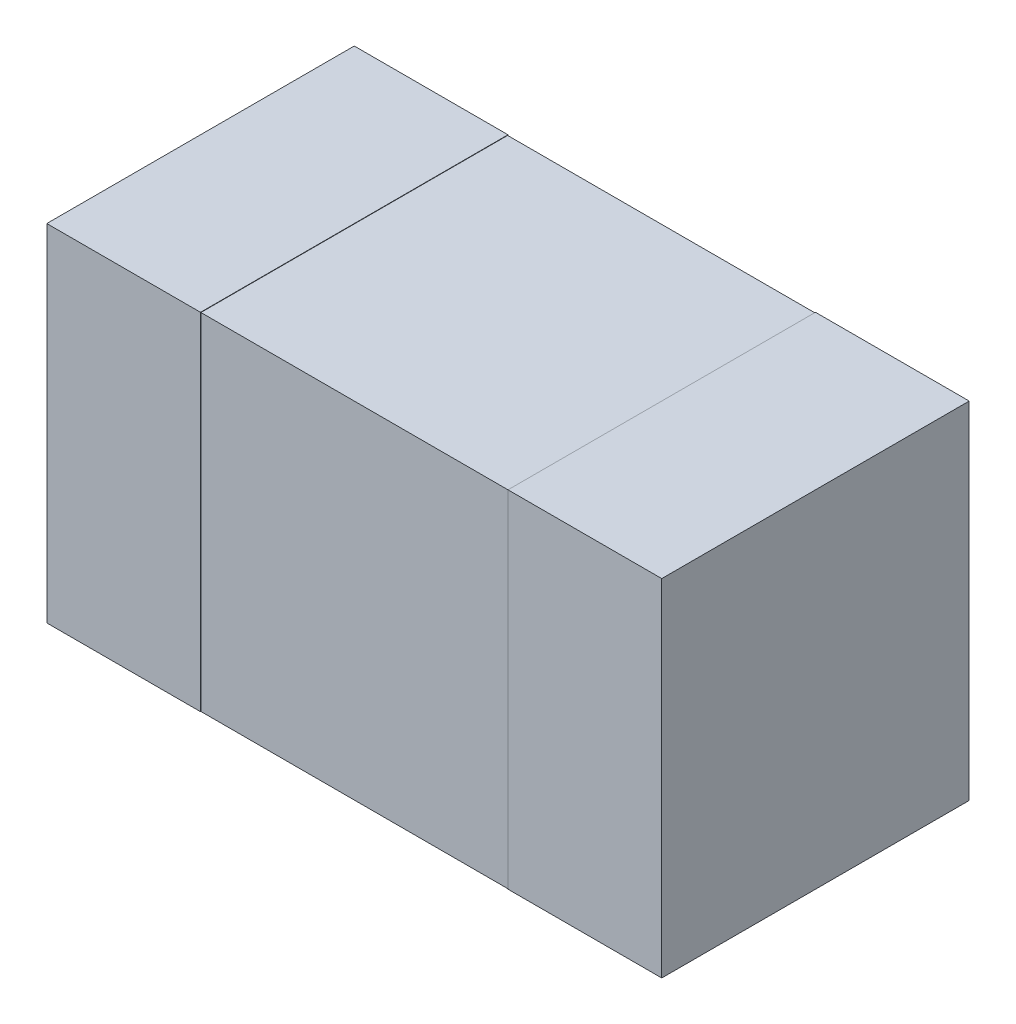
ISO-10303-21;
HEADER;
FILE_DESCRIPTION(('STEP AP214'),'2;1');
FILE_NAME('part.step','',(''),(''),'','','');
FILE_SCHEMA(('AUTOMOTIVE_DESIGN { 1 0 10303 214 1 1 1 1 }'));
ENDSEC;
DATA;
#1=APPLICATION_CONTEXT('core data for automotive mechanical design processes');
#2=APPLICATION_PROTOCOL_DEFINITION('international standard','automotive_design',2000,#1);
#3=PRODUCT_CONTEXT('',#1,'mechanical');
#4=PRODUCT('Part','Part','',(#3));
#5=PRODUCT_RELATED_PRODUCT_CATEGORY('part','',(#4));
#6=PRODUCT_DEFINITION_FORMATION('','',#4);
#7=PRODUCT_DEFINITION_CONTEXT('part definition',#1,'design');
#8=PRODUCT_DEFINITION('design','',#6,#7);
#9=PRODUCT_DEFINITION_SHAPE('','',#8);
#10=(LENGTH_UNIT() NAMED_UNIT(*) SI_UNIT(.MILLI.,.METRE.));
#11=(NAMED_UNIT(*) PLANE_ANGLE_UNIT() SI_UNIT($,.RADIAN.));
#12=(NAMED_UNIT(*) SI_UNIT($,.STERADIAN.) SOLID_ANGLE_UNIT());
#13=UNCERTAINTY_MEASURE_WITH_UNIT(LENGTH_MEASURE(1.E-05),#10,'distance_accuracy_value','');
#14=(GEOMETRIC_REPRESENTATION_CONTEXT(3) GLOBAL_UNCERTAINTY_ASSIGNED_CONTEXT((#13)) GLOBAL_UNIT_ASSIGNED_CONTEXT((#10,
#11,#12)) REPRESENTATION_CONTEXT('',''));
#15=CARTESIAN_POINT('',(0.,0.,0.));
#16=DIRECTION('',(0.,0.,1.));
#17=DIRECTION('',(1.,0.,0.));
#18=AXIS2_PLACEMENT_3D('',#15,#16,#17);
#19=CARTESIAN_POINT('',(0.,0.45,0.4));
#20=DIRECTION('',(0.,1.,0.));
#21=DIRECTION('',(0.,0.,1.));
#22=AXIS2_PLACEMENT_3D('',#19,#20,#21);
#23=PLANE('',#22);
#24=DIRECTION('',(0.,0.,-1.));
#25=VECTOR('',#24,1.);
#26=CARTESIAN_POINT('',(-0.8,0.45,0.8));
#27=LINE('',#26,#25);
#28=CARTESIAN_POINT('',(-0.8,0.45,0.));
#29=VERTEX_POINT('',#28);
#30=CARTESIAN_POINT('',(-0.8,0.45,0.8));
#31=VERTEX_POINT('',#30);
#32=EDGE_CURVE('E224',#29,#31,#27,.F.);
#33=ORIENTED_EDGE('',*,*,#32,.T.);
#34=DIRECTION('',(-1.,0.,0.));
#35=VECTOR('',#34,1.);
#36=CARTESIAN_POINT('',(0.8,0.45,0.8));
#37=LINE('',#36,#35);
#38=CARTESIAN_POINT('',(-0.4,0.45,0.8));
#39=VERTEX_POINT('',#38);
#40=EDGE_CURVE('E218',#31,#39,#37,.F.);
#41=ORIENTED_EDGE('',*,*,#40,.T.);
#42=DIRECTION('',(0.,0.,1.));
#43=VECTOR('',#42,1.);
#44=CARTESIAN_POINT('',(-0.4,0.45,0.8));
#45=LINE('',#44,#43);
#46=CARTESIAN_POINT('',(-0.400000000000043,0.45,0.));
#47=VERTEX_POINT('',#46);
#48=EDGE_CURVE('E212',#39,#47,#45,.F.);
#49=ORIENTED_EDGE('',*,*,#48,.T.);
#50=DIRECTION('',(1.,0.,0.));
#51=VECTOR('',#50,1.);
#52=CARTESIAN_POINT('',(0.8,0.45,0.));
#53=LINE('',#52,#51);
#54=EDGE_CURVE('E94',#47,#29,#53,.F.);
#55=ORIENTED_EDGE('',*,*,#54,.T.);
#56=EDGE_LOOP('',(#33,#41,#49,#55));
#57=FACE_BOUND('',#56,.T.);
#58=ADVANCED_FACE('F17',(#57),#23,.T.);
#59=CARTESIAN_POINT('',(0.,0.45,0.4));
#60=DIRECTION('',(0.,1.,0.));
#61=DIRECTION('',(0.,0.,1.));
#62=AXIS2_PLACEMENT_3D('',#59,#60,#61);
#63=PLANE('',#62);
#64=DIRECTION('',(-1.,0.,0.));
#65=VECTOR('',#64,1.);
#66=CARTESIAN_POINT('',(0.8,0.45,0.8));
#67=LINE('',#66,#65);
#68=CARTESIAN_POINT('',(0.4,0.45,0.8));
#69=VERTEX_POINT('',#68);
#70=CARTESIAN_POINT('',(0.8,0.45,0.8));
#71=VERTEX_POINT('',#70);
#72=EDGE_CURVE('E108',#69,#71,#67,.F.);
#73=ORIENTED_EDGE('',*,*,#72,.T.);
#74=DIRECTION('',(0.,0.,1.));
#75=VECTOR('',#74,1.);
#76=CARTESIAN_POINT('',(0.8,0.45,0.8));
#77=LINE('',#76,#75);
#78=CARTESIAN_POINT('',(0.8,0.45,0.));
#79=VERTEX_POINT('',#78);
#80=EDGE_CURVE('E137',#71,#79,#77,.F.);
#81=ORIENTED_EDGE('',*,*,#80,.T.);
#82=DIRECTION('',(1.,0.,0.));
#83=VECTOR('',#82,1.);
#84=CARTESIAN_POINT('',(0.8,0.45,0.));
#85=LINE('',#84,#83);
#86=CARTESIAN_POINT('',(0.4,0.45,0.));
#87=VERTEX_POINT('',#86);
#88=EDGE_CURVE('E120',#79,#87,#85,.F.);
#89=ORIENTED_EDGE('',*,*,#88,.T.);
#90=DIRECTION('',(0.,0.,-1.));
#91=VECTOR('',#90,1.);
#92=CARTESIAN_POINT('',(0.4,0.45,0.8));
#93=LINE('',#92,#91);
#94=EDGE_CURVE('E185',#87,#69,#93,.F.);
#95=ORIENTED_EDGE('',*,*,#94,.T.);
#96=EDGE_LOOP('',(#73,#81,#89,#95));
#97=FACE_BOUND('',#96,.T.);
#98=ADVANCED_FACE('F289',(#97),#63,.T.);
#99=CARTESIAN_POINT('',(-0.4,0.449,0.));
#100=DIRECTION('',(0.,-1.,0.));
#101=DIRECTION('',(1.,0.,0.));
#102=AXIS2_PLACEMENT_3D('',#99,#100,#101);
#103=PLANE('',#102);
#104=DIRECTION('',(-1.,0.,0.));
#105=VECTOR('',#104,1.);
#106=CARTESIAN_POINT('',(-0.4,0.449,0.799));
#107=LINE('',#106,#105);
#108=CARTESIAN_POINT('',(-0.4,0.449,0.799));
#109=VERTEX_POINT('',#108);
#110=CARTESIAN_POINT('',(0.4,0.449,0.799));
#111=VERTEX_POINT('',#110);
#112=EDGE_CURVE('E115',#109,#111,#107,.F.);
#113=ORIENTED_EDGE('',*,*,#112,.T.);
#114=DIRECTION('',(0.,0.,-1.));
#115=VECTOR('',#114,1.);
#116=CARTESIAN_POINT('',(0.4,0.449,0.8));
#117=LINE('',#116,#115);
#118=CARTESIAN_POINT('',(0.4,0.449,0.00100000000000003));
#119=VERTEX_POINT('',#118);
#120=EDGE_CURVE('E191',#111,#119,#117,.T.);
#121=ORIENTED_EDGE('',*,*,#120,.T.);
#122=DIRECTION('',(1.,0.,0.));
#123=VECTOR('',#122,1.);
#124=CARTESIAN_POINT('',(-0.4,0.449,0.00100000000000003));
#125=LINE('',#124,#123);
#126=CARTESIAN_POINT('',(-0.400000000000014,0.449,0.00100000000000003));
#127=VERTEX_POINT('',#126);
#128=EDGE_CURVE('E177',#119,#127,#125,.F.);
#129=ORIENTED_EDGE('',*,*,#128,.T.);
#130=DIRECTION('',(0.,0.,1.));
#131=VECTOR('',#130,1.);
#132=CARTESIAN_POINT('',(-0.4,0.449,0.8));
#133=LINE('',#132,#131);
#134=EDGE_CURVE('E69',#127,#109,#133,.T.);
#135=ORIENTED_EDGE('',*,*,#134,.T.);
#136=EDGE_LOOP('',(#113,#121,#129,#135));
#137=FACE_BOUND('',#136,.T.);
#138=ADVANCED_FACE('F294',(#137),#103,.F.);
#139=CARTESIAN_POINT('',(0.8,0.45,0.));
#140=DIRECTION('',(0.,0.,1.));
#141=DIRECTION('',(1.,0.,0.));
#142=AXIS2_PLACEMENT_3D('',#139,#140,#141);
#143=PLANE('',#142);
#144=DIRECTION('',(0.,1.,0.));
#145=VECTOR('',#144,1.);
#146=CARTESIAN_POINT('',(-0.400000000000043,0.45,0.));
#147=LINE('',#146,#145);
#148=CARTESIAN_POINT('',(-0.400000000000043,-0.45,0.));
#149=VERTEX_POINT('',#148);
#150=EDGE_CURVE('E210',#47,#149,#147,.F.);
#151=ORIENTED_EDGE('',*,*,#150,.T.);
#152=DIRECTION('',(1.,0.,0.));
#153=VECTOR('',#152,1.);
#154=CARTESIAN_POINT('',(0.,-0.45,0.));
#155=LINE('',#154,#153);
#156=CARTESIAN_POINT('',(-0.8,-0.45,0.));
#157=VERTEX_POINT('',#156);
#158=EDGE_CURVE('E171',#149,#157,#155,.F.);
#159=ORIENTED_EDGE('',*,*,#158,.T.);
#160=DIRECTION('',(0.,1.,0.));
#161=VECTOR('',#160,1.);
#162=CARTESIAN_POINT('',(-0.8,0.45,0.));
#163=LINE('',#162,#161);
#164=EDGE_CURVE('E231',#157,#29,#163,.T.);
#165=ORIENTED_EDGE('',*,*,#164,.T.);
#166=ORIENTED_EDGE('',*,*,#54,.F.);
#167=EDGE_LOOP('',(#151,#159,#165,#166));
#168=FACE_BOUND('',#167,.T.);
#169=ADVANCED_FACE('F286',(#168),#143,.F.);
#170=CARTESIAN_POINT('',(-0.8,0.45,0.8));
#171=DIRECTION('',(1.,0.,0.));
#172=DIRECTION('',(0.,0.,-1.));
#173=AXIS2_PLACEMENT_3D('',#170,#171,#172);
#174=PLANE('',#173);
#175=DIRECTION('',(0.,1.,0.));
#176=VECTOR('',#175,1.);
#177=CARTESIAN_POINT('',(-0.8,0.45,0.8));
#178=LINE('',#177,#176);
#179=CARTESIAN_POINT('',(-0.8,-0.45,0.8));
#180=VERTEX_POINT('',#179);
#181=EDGE_CURVE('E221',#180,#31,#178,.T.);
#182=ORIENTED_EDGE('',*,*,#181,.T.);
#183=ORIENTED_EDGE('',*,*,#32,.F.);
#184=ORIENTED_EDGE('',*,*,#164,.F.);
#185=DIRECTION('',(0.,0.,1.));
#186=VECTOR('',#185,1.);
#187=CARTESIAN_POINT('',(-0.8,-0.45,0.4));
#188=LINE('',#187,#186);
#189=EDGE_CURVE('E168',#157,#180,#188,.T.);
#190=ORIENTED_EDGE('',*,*,#189,.T.);
#191=EDGE_LOOP('',(#182,#183,#184,#190));
#192=FACE_BOUND('',#191,.T.);
#193=ADVANCED_FACE('F285',(#192),#174,.F.);
#194=CARTESIAN_POINT('',(0.8,0.45,0.8));
#195=DIRECTION('',(0.,0.,-1.));
#196=DIRECTION('',(-1.,0.,0.));
#197=AXIS2_PLACEMENT_3D('',#194,#195,#196);
#198=PLANE('',#197);
#199=DIRECTION('',(0.,1.,0.));
#200=VECTOR('',#199,1.);
#201=CARTESIAN_POINT('',(-0.4,0.45,0.8));
#202=LINE('',#201,#200);
#203=CARTESIAN_POINT('',(-0.4,-0.45,0.8));
#204=VERTEX_POINT('',#203);
#205=EDGE_CURVE('E215',#204,#39,#202,.T.);
#206=ORIENTED_EDGE('',*,*,#205,.T.);
#207=ORIENTED_EDGE('',*,*,#40,.F.);
#208=ORIENTED_EDGE('',*,*,#181,.F.);
#209=DIRECTION('',(1.,0.,0.));
#210=VECTOR('',#209,1.);
#211=CARTESIAN_POINT('',(0.,-0.45,0.8));
#212=LINE('',#211,#210);
#213=EDGE_CURVE('E165',#180,#204,#212,.T.);
#214=ORIENTED_EDGE('',*,*,#213,.T.);
#215=EDGE_LOOP('',(#206,#207,#208,#214));
#216=FACE_BOUND('',#215,.T.);
#217=ADVANCED_FACE('F281',(#216),#198,.F.);
#218=CARTESIAN_POINT('',(-0.4,0.45,0.8));
#219=DIRECTION('',(-1.,0.,0.));
#220=DIRECTION('',(0.,0.,1.));
#221=AXIS2_PLACEMENT_3D('',#218,#219,#220);
#222=PLANE('',#221);
#223=DIRECTION('',(0.,1.,0.));
#224=VECTOR('',#223,1.);
#225=CARTESIAN_POINT('',(-0.4,0.45,0.799));
#226=LINE('',#225,#224);
#227=CARTESIAN_POINT('',(-0.4,-0.45,0.799));
#228=VERTEX_POINT('',#227);
#229=EDGE_CURVE('E206',#228,#109,#226,.T.);
#230=ORIENTED_EDGE('',*,*,#229,.T.);
#231=ORIENTED_EDGE('',*,*,#134,.F.);
#232=DIRECTION('',(0.,1.,0.));
#233=VECTOR('',#232,1.);
#234=CARTESIAN_POINT('',(-0.4,0.45,0.00100000000000003));
#235=LINE('',#234,#233);
#236=CARTESIAN_POINT('',(-0.400000000000022,-0.45,0.00100000000000003));
#237=VERTEX_POINT('',#236);
#238=EDGE_CURVE('E180',#127,#237,#235,.F.);
#239=ORIENTED_EDGE('',*,*,#238,.T.);
#240=DIRECTION('',(0.,0.,1.));
#241=VECTOR('',#240,1.);
#242=CARTESIAN_POINT('',(-0.4,-0.45,0.8));
#243=LINE('',#242,#241);
#244=EDGE_CURVE('E20',#237,#149,#243,.F.);
#245=ORIENTED_EDGE('',*,*,#244,.T.);
#246=ORIENTED_EDGE('',*,*,#150,.F.);
#247=ORIENTED_EDGE('',*,*,#48,.F.);
#248=ORIENTED_EDGE('',*,*,#205,.F.);
#249=DIRECTION('',(0.,0.,1.));
#250=VECTOR('',#249,1.);
#251=CARTESIAN_POINT('',(-0.4,-0.45,0.8));
#252=LINE('',#251,#250);
#253=EDGE_CURVE('E164',#204,#228,#252,.F.);
#254=ORIENTED_EDGE('',*,*,#253,.T.);
#255=EDGE_LOOP('',(#230,#231,#239,#245,#246,#247,#248,#254));
#256=FACE_BOUND('',#255,.T.);
#257=ADVANCED_FACE('F275',(#256),#222,.F.);
#258=CARTESIAN_POINT('',(-0.4,0.45,0.799));
#259=DIRECTION('',(0.,0.,-1.));
#260=DIRECTION('',(-1.,0.,0.));
#261=AXIS2_PLACEMENT_3D('',#258,#259,#260);
#262=PLANE('',#261);
#263=ORIENTED_EDGE('',*,*,#112,.F.);
#264=ORIENTED_EDGE('',*,*,#229,.F.);
#265=DIRECTION('',(1.,0.,0.));
#266=VECTOR('',#265,1.);
#267=CARTESIAN_POINT('',(0.,-0.45,0.799));
#268=LINE('',#267,#266);
#269=CARTESIAN_POINT('',(0.4,-0.45,0.799));
#270=VERTEX_POINT('',#269);
#271=EDGE_CURVE('E154',#228,#270,#268,.T.);
#272=ORIENTED_EDGE('',*,*,#271,.T.);
#273=DIRECTION('',(0.,1.,0.));
#274=VECTOR('',#273,1.);
#275=CARTESIAN_POINT('',(0.4,0.45,0.799));
#276=LINE('',#275,#274);
#277=EDGE_CURVE('E194',#270,#111,#276,.T.);
#278=ORIENTED_EDGE('',*,*,#277,.T.);
#279=EDGE_LOOP('',(#263,#264,#272,#278));
#280=FACE_BOUND('',#279,.T.);
#281=ADVANCED_FACE('F314',(#280),#262,.F.);
#282=CARTESIAN_POINT('',(0.8,0.45,0.8));
#283=DIRECTION('',(0.,0.,-1.));
#284=DIRECTION('',(-1.,0.,0.));
#285=AXIS2_PLACEMENT_3D('',#282,#283,#284);
#286=PLANE('',#285);
#287=DIRECTION('',(0.,1.,0.));
#288=VECTOR('',#287,1.);
#289=CARTESIAN_POINT('',(0.4,0.45,0.8));
#290=LINE('',#289,#288);
#291=CARTESIAN_POINT('',(0.4,-0.45,0.8));
#292=VERTEX_POINT('',#291);
#293=EDGE_CURVE('E151',#69,#292,#290,.F.);
#294=ORIENTED_EDGE('',*,*,#293,.T.);
#295=DIRECTION('',(1.,0.,0.));
#296=VECTOR('',#295,1.);
#297=CARTESIAN_POINT('',(0.,-0.45,0.8));
#298=LINE('',#297,#296);
#299=CARTESIAN_POINT('',(0.8,-0.45,0.8));
#300=VERTEX_POINT('',#299);
#301=EDGE_CURVE('E145',#292,#300,#298,.T.);
#302=ORIENTED_EDGE('',*,*,#301,.T.);
#303=DIRECTION('',(0.,1.,0.));
#304=VECTOR('',#303,1.);
#305=CARTESIAN_POINT('',(0.8,0.45,0.8));
#306=LINE('',#305,#304);
#307=EDGE_CURVE('E133',#300,#71,#306,.T.);
#308=ORIENTED_EDGE('',*,*,#307,.T.);
#309=ORIENTED_EDGE('',*,*,#72,.F.);
#310=EDGE_LOOP('',(#294,#302,#308,#309));
#311=FACE_BOUND('',#310,.T.);
#312=ADVANCED_FACE('F149',(#311),#286,.F.);
#313=CARTESIAN_POINT('',(0.8,0.45,0.8));
#314=DIRECTION('',(-1.,0.,0.));
#315=DIRECTION('',(0.,0.,1.));
#316=AXIS2_PLACEMENT_3D('',#313,#314,#315);
#317=PLANE('',#316);
#318=DIRECTION('',(0.,1.,0.));
#319=VECTOR('',#318,1.);
#320=CARTESIAN_POINT('',(0.8,0.45,0.));
#321=LINE('',#320,#319);
#322=CARTESIAN_POINT('',(0.8,-0.45,0.));
#323=VERTEX_POINT('',#322);
#324=EDGE_CURVE('E127',#323,#79,#321,.T.);
#325=ORIENTED_EDGE('',*,*,#324,.T.);
#326=ORIENTED_EDGE('',*,*,#80,.F.);
#327=ORIENTED_EDGE('',*,*,#307,.F.);
#328=DIRECTION('',(0.,0.,1.));
#329=VECTOR('',#328,1.);
#330=CARTESIAN_POINT('',(0.8,-0.45,0.4));
#331=LINE('',#330,#329);
#332=EDGE_CURVE('E136',#300,#323,#331,.F.);
#333=ORIENTED_EDGE('',*,*,#332,.T.);
#334=EDGE_LOOP('',(#325,#326,#327,#333));
#335=FACE_BOUND('',#334,.T.);
#336=ADVANCED_FACE('F135',(#335),#317,.F.);
#337=CARTESIAN_POINT('',(0.8,0.45,0.));
#338=DIRECTION('',(0.,0.,1.));
#339=DIRECTION('',(1.,0.,0.));
#340=AXIS2_PLACEMENT_3D('',#337,#338,#339);
#341=PLANE('',#340);
#342=DIRECTION('',(0.,1.,0.));
#343=VECTOR('',#342,1.);
#344=CARTESIAN_POINT('',(0.4,0.45,0.));
#345=LINE('',#344,#343);
#346=CARTESIAN_POINT('',(0.4,-0.45,0.));
#347=VERTEX_POINT('',#346);
#348=EDGE_CURVE('E188',#347,#87,#345,.T.);
#349=ORIENTED_EDGE('',*,*,#348,.T.);
#350=ORIENTED_EDGE('',*,*,#88,.F.);
#351=ORIENTED_EDGE('',*,*,#324,.F.);
#352=DIRECTION('',(1.,0.,0.));
#353=VECTOR('',#352,1.);
#354=CARTESIAN_POINT('',(0.,-0.45,0.));
#355=LINE('',#354,#353);
#356=EDGE_CURVE('E147',#323,#347,#355,.F.);
#357=ORIENTED_EDGE('',*,*,#356,.T.);
#358=EDGE_LOOP('',(#349,#350,#351,#357));
#359=FACE_BOUND('',#358,.T.);
#360=ADVANCED_FACE('F306',(#359),#341,.F.);
#361=CARTESIAN_POINT('',(0.4,0.45,0.8));
#362=DIRECTION('',(1.,0.,0.));
#363=DIRECTION('',(0.,0.,-1.));
#364=AXIS2_PLACEMENT_3D('',#361,#362,#363);
#365=PLANE('',#364);
#366=ORIENTED_EDGE('',*,*,#293,.F.);
#367=ORIENTED_EDGE('',*,*,#94,.F.);
#368=ORIENTED_EDGE('',*,*,#348,.F.);
#369=DIRECTION('',(0.,0.,-1.));
#370=VECTOR('',#369,1.);
#371=CARTESIAN_POINT('',(0.4,-0.45,0.8));
#372=LINE('',#371,#370);
#373=CARTESIAN_POINT('',(0.4,-0.45,0.00100000000000003));
#374=VERTEX_POINT('',#373);
#375=EDGE_CURVE('E26',#347,#374,#372,.F.);
#376=ORIENTED_EDGE('',*,*,#375,.T.);
#377=DIRECTION('',(0.,1.,0.));
#378=VECTOR('',#377,1.);
#379=CARTESIAN_POINT('',(0.4,0.45,0.00100000000000003));
#380=LINE('',#379,#378);
#381=EDGE_CURVE('E34',#374,#119,#380,.T.);
#382=ORIENTED_EDGE('',*,*,#381,.T.);
#383=ORIENTED_EDGE('',*,*,#120,.F.);
#384=ORIENTED_EDGE('',*,*,#277,.F.);
#385=DIRECTION('',(0.,0.,-1.));
#386=VECTOR('',#385,1.);
#387=CARTESIAN_POINT('',(0.4,-0.45,0.8));
#388=LINE('',#387,#386);
#389=EDGE_CURVE('E152',#270,#292,#388,.F.);
#390=ORIENTED_EDGE('',*,*,#389,.T.);
#391=EDGE_LOOP('',(#366,#367,#368,#376,#382,#383,#384,#390));
#392=FACE_BOUND('',#391,.T.);
#393=ADVANCED_FACE('F301',(#392),#365,.F.);
#394=CARTESIAN_POINT('',(-0.4,0.45,0.00100000000000003));
#395=DIRECTION('',(0.,0.,1.));
#396=DIRECTION('',(1.,0.,0.));
#397=AXIS2_PLACEMENT_3D('',#394,#395,#396);
#398=PLANE('',#397);
#399=ORIENTED_EDGE('',*,*,#128,.F.);
#400=ORIENTED_EDGE('',*,*,#381,.F.);
#401=DIRECTION('',(1.,0.,0.));
#402=VECTOR('',#401,1.);
#403=CARTESIAN_POINT('',(0.,-0.45,0.00100000000000002));
#404=LINE('',#403,#402);
#405=EDGE_CURVE('E11',#374,#237,#404,.F.);
#406=ORIENTED_EDGE('',*,*,#405,.T.);
#407=ORIENTED_EDGE('',*,*,#238,.F.);
#408=EDGE_LOOP('',(#399,#400,#406,#407));
#409=FACE_BOUND('',#408,.T.);
#410=ADVANCED_FACE('F296',(#409),#398,.F.);
#411=CARTESIAN_POINT('',(0.,-0.45,0.4));
#412=DIRECTION('',(0.,1.,0.));
#413=DIRECTION('',(0.,0.,1.));
#414=AXIS2_PLACEMENT_3D('',#411,#412,#413);
#415=PLANE('',#414);
#416=ORIENTED_EDGE('',*,*,#375,.F.);
#417=ORIENTED_EDGE('',*,*,#356,.F.);
#418=ORIENTED_EDGE('',*,*,#332,.F.);
#419=ORIENTED_EDGE('',*,*,#301,.F.);
#420=ORIENTED_EDGE('',*,*,#389,.F.);
#421=ORIENTED_EDGE('',*,*,#271,.F.);
#422=ORIENTED_EDGE('',*,*,#253,.F.);
#423=ORIENTED_EDGE('',*,*,#213,.F.);
#424=ORIENTED_EDGE('',*,*,#189,.F.);
#425=ORIENTED_EDGE('',*,*,#158,.F.);
#426=ORIENTED_EDGE('',*,*,#244,.F.);
#427=ORIENTED_EDGE('',*,*,#405,.F.);
#428=EDGE_LOOP('',(#416,#417,#418,#419,#420,#421,#422,#423,#424,#425,#426,#427));
#429=FACE_BOUND('',#428,.T.);
#430=ADVANCED_FACE('F143',(#429),#415,.F.);
#431=CLOSED_SHELL('',(#58,#98,#138,#169,#193,#217,#257,#281,#312,#336,#360,#393,#410,#430));
#432=MANIFOLD_SOLID_BREP('B1',#431);
#433=ADVANCED_BREP_SHAPE_REPRESENTATION('',(#18,#432),#14);
#434=SHAPE_DEFINITION_REPRESENTATION(#9,#433);
ENDSEC;
END-ISO-10303-21;
